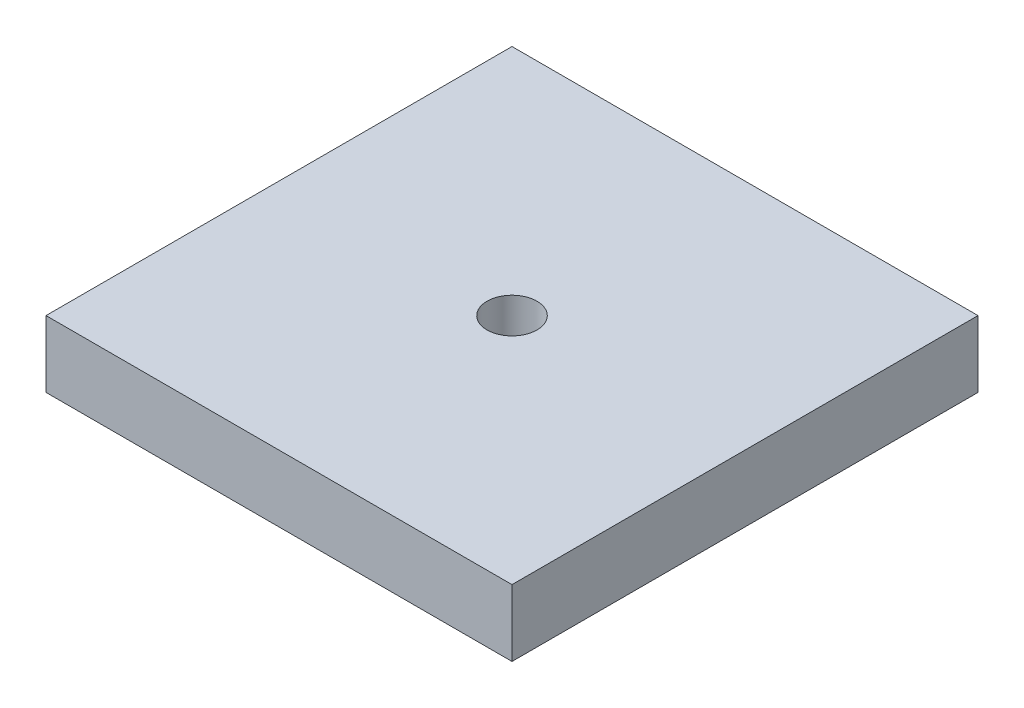
ISO-10303-21;
HEADER;
FILE_DESCRIPTION(('STEP AP214'),'2;1');
FILE_NAME('part.step','',(''),(''),'','','');
FILE_SCHEMA(('AUTOMOTIVE_DESIGN { 1 0 10303 214 1 1 1 1 }'));
ENDSEC;
DATA;
#1=APPLICATION_CONTEXT('core data for automotive mechanical design processes');
#2=APPLICATION_PROTOCOL_DEFINITION('international standard','automotive_design',2000,#1);
#3=PRODUCT_CONTEXT('',#1,'mechanical');
#4=PRODUCT('Part','Part','',(#3));
#5=PRODUCT_RELATED_PRODUCT_CATEGORY('part','',(#4));
#6=PRODUCT_DEFINITION_FORMATION('','',#4);
#7=PRODUCT_DEFINITION_CONTEXT('part definition',#1,'design');
#8=PRODUCT_DEFINITION('design','',#6,#7);
#9=PRODUCT_DEFINITION_SHAPE('','',#8);
#10=(LENGTH_UNIT() NAMED_UNIT(*) SI_UNIT(.MILLI.,.METRE.));
#11=(NAMED_UNIT(*) PLANE_ANGLE_UNIT() SI_UNIT($,.RADIAN.));
#12=(NAMED_UNIT(*) SI_UNIT($,.STERADIAN.) SOLID_ANGLE_UNIT());
#13=UNCERTAINTY_MEASURE_WITH_UNIT(LENGTH_MEASURE(1.E-05),#10,'distance_accuracy_value','');
#14=(GEOMETRIC_REPRESENTATION_CONTEXT(3) GLOBAL_UNCERTAINTY_ASSIGNED_CONTEXT((#13)) GLOBAL_UNIT_ASSIGNED_CONTEXT((#10,
#11,#12)) REPRESENTATION_CONTEXT('',''));
#15=CARTESIAN_POINT('',(0.,0.,0.));
#16=DIRECTION('',(0.,0.,1.));
#17=DIRECTION('',(1.,0.,0.));
#18=AXIS2_PLACEMENT_3D('',#15,#16,#17);
#19=CARTESIAN_POINT('',(0.,1.6,-11.2));
#20=DIRECTION('',(0.,0.,-1.));
#21=DIRECTION('',(-1.,0.,0.));
#22=AXIS2_PLACEMENT_3D('',#19,#20,#21);
#23=PLANE('',#22);
#24=DIRECTION('',(1.,0.,0.));
#25=VECTOR('',#24,1.);
#26=CARTESIAN_POINT('',(0.,0.,-11.2));
#27=LINE('',#26,#25);
#28=CARTESIAN_POINT('',(0.,0.,-11.2));
#29=VERTEX_POINT('',#28);
#30=CARTESIAN_POINT('',(11.2,0.,-11.2));
#31=VERTEX_POINT('',#30);
#32=EDGE_CURVE('E101',#29,#31,#27,.T.);
#33=ORIENTED_EDGE('',*,*,#32,.F.);
#34=DIRECTION('',(0.,-1.,0.));
#35=VECTOR('',#34,1.);
#36=CARTESIAN_POINT('',(0.,1.6,-11.2));
#37=LINE('',#36,#35);
#38=CARTESIAN_POINT('',(0.,1.6,-11.2));
#39=VERTEX_POINT('',#38);
#40=EDGE_CURVE('E11',#39,#29,#37,.T.);
#41=ORIENTED_EDGE('',*,*,#40,.F.);
#42=DIRECTION('',(1.,0.,0.));
#43=VECTOR('',#42,1.);
#44=CARTESIAN_POINT('',(0.,1.6,-11.2));
#45=LINE('',#44,#43);
#46=CARTESIAN_POINT('',(11.2,1.6,-11.2));
#47=VERTEX_POINT('',#46);
#48=EDGE_CURVE('E94',#39,#47,#45,.T.);
#49=ORIENTED_EDGE('',*,*,#48,.T.);
#50=DIRECTION('',(0.,-1.,0.));
#51=VECTOR('',#50,1.);
#52=CARTESIAN_POINT('',(11.2,1.6,-11.2));
#53=LINE('',#52,#51);
#54=EDGE_CURVE('E91',#47,#31,#53,.T.);
#55=ORIENTED_EDGE('',*,*,#54,.T.);
#56=EDGE_LOOP('',(#33,#41,#49,#55));
#57=FACE_BOUND('',#56,.T.);
#58=ADVANCED_FACE('F34',(#57),#23,.T.);
#59=CARTESIAN_POINT('',(0.,1.6,0.));
#60=DIRECTION('',(-1.,0.,0.));
#61=DIRECTION('',(0.,0.,1.));
#62=AXIS2_PLACEMENT_3D('',#59,#60,#61);
#63=PLANE('',#62);
#64=DIRECTION('',(0.,0.,-1.));
#65=VECTOR('',#64,1.);
#66=CARTESIAN_POINT('',(0.,0.,0.));
#67=LINE('',#66,#65);
#68=CARTESIAN_POINT('',(0.,0.,0.));
#69=VERTEX_POINT('',#68);
#70=EDGE_CURVE('E96',#69,#29,#67,.T.);
#71=ORIENTED_EDGE('',*,*,#70,.F.);
#72=DIRECTION('',(0.,-1.,0.));
#73=VECTOR('',#72,1.);
#74=CARTESIAN_POINT('',(0.,1.6,0.));
#75=LINE('',#74,#73);
#76=CARTESIAN_POINT('',(0.,1.6,0.));
#77=VERTEX_POINT('',#76);
#78=EDGE_CURVE('E43',#77,#69,#75,.T.);
#79=ORIENTED_EDGE('',*,*,#78,.F.);
#80=DIRECTION('',(0.,0.,-1.));
#81=VECTOR('',#80,1.);
#82=CARTESIAN_POINT('',(0.,1.6,0.));
#83=LINE('',#82,#81);
#84=EDGE_CURVE('E82',#77,#39,#83,.T.);
#85=ORIENTED_EDGE('',*,*,#84,.T.);
#86=ORIENTED_EDGE('',*,*,#40,.T.);
#87=EDGE_LOOP('',(#71,#79,#85,#86));
#88=FACE_BOUND('',#87,.T.);
#89=ADVANCED_FACE('F111',(#88),#63,.T.);
#90=CARTESIAN_POINT('',(0.,1.6,0.));
#91=DIRECTION('',(0.,0.,-1.));
#92=DIRECTION('',(-1.,0.,0.));
#93=AXIS2_PLACEMENT_3D('',#90,#91,#92);
#94=PLANE('',#93);
#95=DIRECTION('',(1.,0.,0.));
#96=VECTOR('',#95,1.);
#97=CARTESIAN_POINT('',(0.,0.,0.));
#98=LINE('',#97,#96);
#99=CARTESIAN_POINT('',(11.2,0.,0.));
#100=VERTEX_POINT('',#99);
#101=EDGE_CURVE('E87',#69,#100,#98,.T.);
#102=ORIENTED_EDGE('',*,*,#101,.T.);
#103=DIRECTION('',(0.,-1.,0.));
#104=VECTOR('',#103,1.);
#105=CARTESIAN_POINT('',(11.2,1.6,0.));
#106=LINE('',#105,#104);
#107=CARTESIAN_POINT('',(11.2,1.6,0.));
#108=VERTEX_POINT('',#107);
#109=EDGE_CURVE('E85',#108,#100,#106,.T.);
#110=ORIENTED_EDGE('',*,*,#109,.F.);
#111=DIRECTION('',(1.,0.,0.));
#112=VECTOR('',#111,1.);
#113=CARTESIAN_POINT('',(0.,1.6,0.));
#114=LINE('',#113,#112);
#115=EDGE_CURVE('E79',#77,#108,#114,.T.);
#116=ORIENTED_EDGE('',*,*,#115,.F.);
#117=ORIENTED_EDGE('',*,*,#78,.T.);
#118=EDGE_LOOP('',(#102,#110,#116,#117));
#119=FACE_BOUND('',#118,.T.);
#120=ADVANCED_FACE('F86',(#119),#94,.F.);
#121=CARTESIAN_POINT('',(11.2,1.6,0.));
#122=DIRECTION('',(-1.,0.,0.));
#123=DIRECTION('',(0.,0.,1.));
#124=AXIS2_PLACEMENT_3D('',#121,#122,#123);
#125=PLANE('',#124);
#126=DIRECTION('',(0.,0.,-1.));
#127=VECTOR('',#126,1.);
#128=CARTESIAN_POINT('',(11.2,0.,0.));
#129=LINE('',#128,#127);
#130=EDGE_CURVE('E104',#100,#31,#129,.T.);
#131=ORIENTED_EDGE('',*,*,#130,.T.);
#132=ORIENTED_EDGE('',*,*,#54,.F.);
#133=DIRECTION('',(0.,0.,-1.));
#134=VECTOR('',#133,1.);
#135=CARTESIAN_POINT('',(11.2,1.6,0.));
#136=LINE('',#135,#134);
#137=EDGE_CURVE('E76',#108,#47,#136,.T.);
#138=ORIENTED_EDGE('',*,*,#137,.F.);
#139=ORIENTED_EDGE('',*,*,#109,.T.);
#140=EDGE_LOOP('',(#131,#132,#138,#139));
#141=FACE_BOUND('',#140,.T.);
#142=ADVANCED_FACE('F93',(#141),#125,.F.);
#143=CARTESIAN_POINT('',(0.,1.6,0.));
#144=DIRECTION('',(0.,1.,0.));
#145=DIRECTION('',(0.,0.,1.));
#146=AXIS2_PLACEMENT_3D('',#143,#144,#145);
#147=PLANE('',#146);
#148=CARTESIAN_POINT('',(5.6,1.6,-5.6));
#149=DIRECTION('',(0.,1.,0.));
#150=DIRECTION('',(0.,0.,1.));
#151=AXIS2_PLACEMENT_3D('',#148,#149,#150);
#152=CIRCLE('',#151,0.6);
#153=CARTESIAN_POINT('',(5.6,1.6,-5.));
#154=VERTEX_POINT('',#153);
#155=EDGE_CURVE('E139',#154,#154,#152,.T.);
#156=ORIENTED_EDGE('',*,*,#155,.F.);
#157=EDGE_LOOP('',(#156));
#158=FACE_BOUND('',#157,.T.);
#159=ORIENTED_EDGE('',*,*,#48,.F.);
#160=ORIENTED_EDGE('',*,*,#84,.F.);
#161=ORIENTED_EDGE('',*,*,#115,.T.);
#162=ORIENTED_EDGE('',*,*,#137,.T.);
#163=EDGE_LOOP('',(#159,#160,#161,#162));
#164=FACE_BOUND('',#163,.T.);
#165=ADVANCED_FACE('F81',(#158,#164),#147,.T.);
#166=CARTESIAN_POINT('',(0.,0.,0.));
#167=DIRECTION('',(0.,1.,0.));
#168=DIRECTION('',(0.,0.,1.));
#169=AXIS2_PLACEMENT_3D('',#166,#167,#168);
#170=PLANE('',#169);
#171=CARTESIAN_POINT('',(5.6,0.,-5.6));
#172=DIRECTION('',(0.,1.,0.));
#173=DIRECTION('',(0.,0.,1.));
#174=AXIS2_PLACEMENT_3D('',#171,#172,#173);
#175=CIRCLE('',#174,0.6);
#176=CARTESIAN_POINT('',(5.6,0.,-5.));
#177=VERTEX_POINT('',#176);
#178=EDGE_CURVE('E37',#177,#177,#175,.T.);
#179=ORIENTED_EDGE('',*,*,#178,.T.);
#180=EDGE_LOOP('',(#179));
#181=FACE_BOUND('',#180,.T.);
#182=ORIENTED_EDGE('',*,*,#32,.T.);
#183=ORIENTED_EDGE('',*,*,#130,.F.);
#184=ORIENTED_EDGE('',*,*,#101,.F.);
#185=ORIENTED_EDGE('',*,*,#70,.T.);
#186=EDGE_LOOP('',(#182,#183,#184,#185));
#187=FACE_BOUND('',#186,.T.);
#188=ADVANCED_FACE('F110',(#181,#187),#170,.F.);
#189=CARTESIAN_POINT('',(5.6,-3.4,-5.6));
#190=DIRECTION('',(0.,1.,0.));
#191=DIRECTION('',(0.,0.,1.));
#192=AXIS2_PLACEMENT_3D('',#189,#190,#191);
#193=CYLINDRICAL_SURFACE('',#192,0.6);
#194=ORIENTED_EDGE('',*,*,#155,.T.);
#195=EDGE_LOOP('',(#194));
#196=FACE_BOUND('',#195,.T.);
#197=ORIENTED_EDGE('',*,*,#178,.F.);
#198=EDGE_LOOP('',(#197));
#199=FACE_BOUND('',#198,.T.);
#200=ADVANCED_FACE('F129',(#196,#199),#193,.F.);
#201=CLOSED_SHELL('',(#58,#89,#120,#142,#165,#188,#200));
#202=MANIFOLD_SOLID_BREP('B2',#201);
#203=ADVANCED_BREP_SHAPE_REPRESENTATION('',(#18,#202),#14);
#204=SHAPE_DEFINITION_REPRESENTATION(#9,#203);
ENDSEC;
END-ISO-10303-21;
